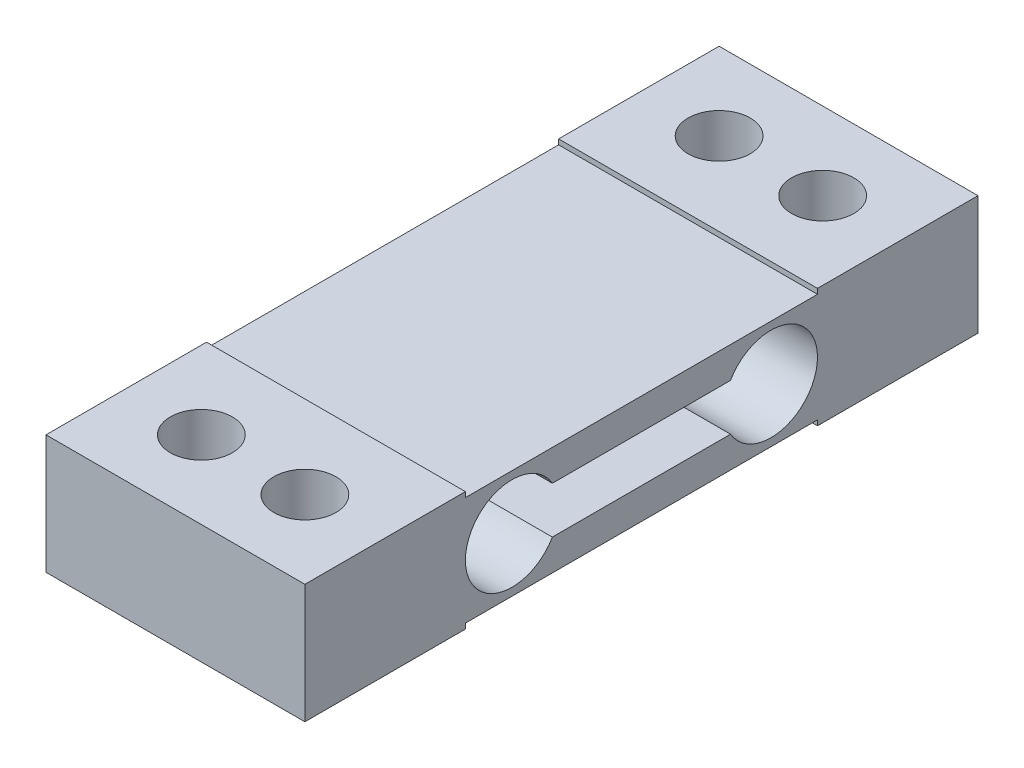
ISO-10303-21;
HEADER;
FILE_DESCRIPTION(('STEP AP214'),'2;1');
FILE_NAME('part.step','',(''),(''),'','','');
FILE_SCHEMA(('AUTOMOTIVE_DESIGN { 1 0 10303 214 1 1 1 1 }'));
ENDSEC;
DATA;
#1=APPLICATION_CONTEXT('core data for automotive mechanical design processes');
#2=APPLICATION_PROTOCOL_DEFINITION('international standard','automotive_design',2000,#1);
#3=PRODUCT_CONTEXT('',#1,'mechanical');
#4=PRODUCT('Part','Part','',(#3));
#5=PRODUCT_RELATED_PRODUCT_CATEGORY('part','',(#4));
#6=PRODUCT_DEFINITION_FORMATION('','',#4);
#7=PRODUCT_DEFINITION_CONTEXT('part definition',#1,'design');
#8=PRODUCT_DEFINITION('design','',#6,#7);
#9=PRODUCT_DEFINITION_SHAPE('','',#8);
#10=(LENGTH_UNIT() NAMED_UNIT(*) SI_UNIT(.MILLI.,.METRE.));
#11=(NAMED_UNIT(*) PLANE_ANGLE_UNIT() SI_UNIT($,.RADIAN.));
#12=(NAMED_UNIT(*) SI_UNIT($,.STERADIAN.) SOLID_ANGLE_UNIT());
#13=UNCERTAINTY_MEASURE_WITH_UNIT(LENGTH_MEASURE(1.E-05),#10,'distance_accuracy_value','');
#14=(GEOMETRIC_REPRESENTATION_CONTEXT(3) GLOBAL_UNCERTAINTY_ASSIGNED_CONTEXT((#13)) GLOBAL_UNIT_ASSIGNED_CONTEXT((#10,
#11,#12)) REPRESENTATION_CONTEXT('',''));
#15=CARTESIAN_POINT('',(0.,0.,0.));
#16=DIRECTION('',(0.,0.,1.));
#17=DIRECTION('',(1.,0.,0.));
#18=AXIS2_PLACEMENT_3D('',#15,#16,#17);
#19=CARTESIAN_POINT('',(50.,0.,0.));
#20=DIRECTION('',(0.,1.,0.));
#21=DIRECTION('',(0.,0.,1.));
#22=AXIS2_PLACEMENT_3D('',#19,#20,#21);
#23=PLANE('',#22);
#24=CARTESIAN_POINT('',(35.,0.,-115.));
#25=DIRECTION('',(0.,1.,0.));
#26=DIRECTION('',(0.,0.,1.));
#27=AXIS2_PLACEMENT_3D('',#24,#25,#26);
#28=CIRCLE('',#27,6.);
#29=CARTESIAN_POINT('',(35.,0.,-109.));
#30=VERTEX_POINT('',#29);
#31=EDGE_CURVE('E203',#30,#30,#28,.T.);
#32=ORIENTED_EDGE('',*,*,#31,.T.);
#33=EDGE_LOOP('',(#32));
#34=FACE_BOUND('',#33,.T.);
#35=CARTESIAN_POINT('',(15.,0.,-115.));
#36=DIRECTION('',(0.,1.,0.));
#37=DIRECTION('',(0.,0.,-1.));
#38=AXIS2_PLACEMENT_3D('',#35,#36,#37);
#39=CIRCLE('',#38,6.);
#40=CARTESIAN_POINT('',(15.,0.,-121.));
#41=VERTEX_POINT('',#40);
#42=EDGE_CURVE('E216',#41,#41,#39,.T.);
#43=ORIENTED_EDGE('',*,*,#42,.T.);
#44=EDGE_LOOP('',(#43));
#45=FACE_BOUND('',#44,.T.);
#46=DIRECTION('',(0.,0.,-1.));
#47=VECTOR('',#46,1.);
#48=CARTESIAN_POINT('',(50.,0.,0.));
#49=LINE('',#48,#47);
#50=CARTESIAN_POINT('',(50.,0.,-99.));
#51=VERTEX_POINT('',#50);
#52=CARTESIAN_POINT('',(50.,0.,-130.));
#53=VERTEX_POINT('',#52);
#54=EDGE_CURVE('E260',#51,#53,#49,.T.);
#55=ORIENTED_EDGE('',*,*,#54,.F.);
#56=DIRECTION('',(1.,0.,0.));
#57=VECTOR('',#56,1.);
#58=CARTESIAN_POINT('',(0.,0.,-99.));
#59=LINE('',#58,#57);
#60=CARTESIAN_POINT('',(0.,0.,-99.));
#61=VERTEX_POINT('',#60);
#62=EDGE_CURVE('E164',#61,#51,#59,.T.);
#63=ORIENTED_EDGE('',*,*,#62,.F.);
#64=DIRECTION('',(0.,0.,-1.));
#65=VECTOR('',#64,1.);
#66=CARTESIAN_POINT('',(0.,0.,0.));
#67=LINE('',#66,#65);
#68=CARTESIAN_POINT('',(0.,0.,-130.));
#69=VERTEX_POINT('',#68);
#70=EDGE_CURVE('E272',#61,#69,#67,.T.);
#71=ORIENTED_EDGE('',*,*,#70,.T.);
#72=DIRECTION('',(-1.,0.,0.));
#73=VECTOR('',#72,1.);
#74=CARTESIAN_POINT('',(50.,0.,-130.));
#75=LINE('',#74,#73);
#76=EDGE_CURVE('E44',#53,#69,#75,.T.);
#77=ORIENTED_EDGE('',*,*,#76,.F.);
#78=EDGE_LOOP('',(#55,#63,#71,#77));
#79=FACE_BOUND('',#78,.T.);
#80=ADVANCED_FACE('F36',(#34,#45,#79),#23,.F.);
#81=CARTESIAN_POINT('',(50.,0.,0.));
#82=DIRECTION('',(-1.,0.,0.));
#83=DIRECTION('',(0.,0.,1.));
#84=AXIS2_PLACEMENT_3D('',#81,#82,#83);
#85=PLANE('',#84);
#86=CARTESIAN_POINT('',(50.,11.5,-40.));
#87=DIRECTION('',(1.,0.,0.));
#88=DIRECTION('',(0.,0.,1.));
#89=AXIS2_PLACEMENT_3D('',#86,#87,#88);
#90=CIRCLE('',#89,8.99999999999999);
#91=CARTESIAN_POINT('',(50.,16.,-47.7942286340599));
#92=VERTEX_POINT('',#91);
#93=CARTESIAN_POINT('',(50.,7.,-47.7942286340599));
#94=VERTEX_POINT('',#93);
#95=EDGE_CURVE('E227',#92,#94,#90,.T.);
#96=ORIENTED_EDGE('',*,*,#95,.F.);
#97=DIRECTION('',(0.,0.,1.));
#98=VECTOR('',#97,1.);
#99=CARTESIAN_POINT('',(50.,16.,-82.2057713659401));
#100=LINE('',#99,#98);
#101=CARTESIAN_POINT('',(50.,16.,-82.2057713659401));
#102=VERTEX_POINT('',#101);
#103=EDGE_CURVE('E235',#102,#92,#100,.T.);
#104=ORIENTED_EDGE('',*,*,#103,.F.);
#105=CARTESIAN_POINT('',(50.,11.5,-90.));
#106=DIRECTION('',(1.,0.,0.));
#107=DIRECTION('',(0.,0.,-1.));
#108=AXIS2_PLACEMENT_3D('',#105,#106,#107);
#109=CIRCLE('',#108,8.99999999999999);
#110=CARTESIAN_POINT('',(50.,7.,-82.2057713659401));
#111=VERTEX_POINT('',#110);
#112=EDGE_CURVE('E232',#111,#102,#109,.T.);
#113=ORIENTED_EDGE('',*,*,#112,.F.);
#114=DIRECTION('',(0.,0.,-1.));
#115=VECTOR('',#114,1.);
#116=CARTESIAN_POINT('',(50.,7.,-82.2057713659401));
#117=LINE('',#116,#115);
#118=EDGE_CURVE('E229',#94,#111,#117,.T.);
#119=ORIENTED_EDGE('',*,*,#118,.F.);
#120=EDGE_LOOP('',(#96,#104,#113,#119));
#121=FACE_BOUND('',#120,.T.);
#122=DIRECTION('',(0.,0.,1.));
#123=VECTOR('',#122,1.);
#124=CARTESIAN_POINT('',(50.,1.,-31.));
#125=LINE('',#124,#123);
#126=CARTESIAN_POINT('',(50.,1.,-99.));
#127=VERTEX_POINT('',#126);
#128=CARTESIAN_POINT('',(50.,1.,-31.));
#129=VERTEX_POINT('',#128);
#130=EDGE_CURVE('E155',#127,#129,#125,.T.);
#131=ORIENTED_EDGE('',*,*,#130,.F.);
#132=DIRECTION('',(0.,-1.,0.));
#133=VECTOR('',#132,1.);
#134=CARTESIAN_POINT('',(50.,1.,-99.));
#135=LINE('',#134,#133);
#136=EDGE_CURVE('E190',#127,#51,#135,.T.);
#137=ORIENTED_EDGE('',*,*,#136,.T.);
#138=ORIENTED_EDGE('',*,*,#54,.T.);
#139=DIRECTION('',(0.,1.,0.));
#140=VECTOR('',#139,1.);
#141=CARTESIAN_POINT('',(50.,0.,-130.));
#142=LINE('',#141,#140);
#143=CARTESIAN_POINT('',(50.,23.,-130.));
#144=VERTEX_POINT('',#143);
#145=EDGE_CURVE('E263',#53,#144,#142,.T.);
#146=ORIENTED_EDGE('',*,*,#145,.T.);
#147=DIRECTION('',(0.,0.,1.));
#148=VECTOR('',#147,1.);
#149=CARTESIAN_POINT('',(50.,23.,0.));
#150=LINE('',#149,#148);
#151=CARTESIAN_POINT('',(50.,23.,-99.));
#152=VERTEX_POINT('',#151);
#153=EDGE_CURVE('E266',#144,#152,#150,.T.);
#154=ORIENTED_EDGE('',*,*,#153,.T.);
#155=DIRECTION('',(0.,1.,0.));
#156=VECTOR('',#155,1.);
#157=CARTESIAN_POINT('',(50.,22.,-99.));
#158=LINE('',#157,#156);
#159=CARTESIAN_POINT('',(50.,22.,-99.));
#160=VERTEX_POINT('',#159);
#161=EDGE_CURVE('E197',#160,#152,#158,.T.);
#162=ORIENTED_EDGE('',*,*,#161,.F.);
#163=DIRECTION('',(0.,0.,-1.));
#164=VECTOR('',#163,1.);
#165=CARTESIAN_POINT('',(50.,22.,0.));
#166=LINE('',#165,#164);
#167=CARTESIAN_POINT('',(50.,22.,-31.));
#168=VERTEX_POINT('',#167);
#169=EDGE_CURVE('E183',#168,#160,#166,.T.);
#170=ORIENTED_EDGE('',*,*,#169,.F.);
#171=DIRECTION('',(0.,1.,0.));
#172=VECTOR('',#171,1.);
#173=CARTESIAN_POINT('',(50.,22.,-31.));
#174=LINE('',#173,#172);
#175=CARTESIAN_POINT('',(50.,23.,-31.));
#176=VERTEX_POINT('',#175);
#177=EDGE_CURVE('E199',#168,#176,#174,.T.);
#178=ORIENTED_EDGE('',*,*,#177,.T.);
#179=CARTESIAN_POINT('',(50.,23.,0.));
#180=VERTEX_POINT('',#179);
#181=EDGE_CURVE('E265',#176,#180,#150,.T.);
#182=ORIENTED_EDGE('',*,*,#181,.T.);
#183=DIRECTION('',(0.,-1.,0.));
#184=VECTOR('',#183,1.);
#185=CARTESIAN_POINT('',(50.,0.,0.));
#186=LINE('',#185,#184);
#187=CARTESIAN_POINT('',(50.,0.,0.));
#188=VERTEX_POINT('',#187);
#189=EDGE_CURVE('E258',#180,#188,#186,.T.);
#190=ORIENTED_EDGE('',*,*,#189,.T.);
#191=CARTESIAN_POINT('',(50.,0.,-31.));
#192=VERTEX_POINT('',#191);
#193=EDGE_CURVE('E169',#188,#192,#49,.T.);
#194=ORIENTED_EDGE('',*,*,#193,.T.);
#195=DIRECTION('',(0.,-1.,0.));
#196=VECTOR('',#195,1.);
#197=CARTESIAN_POINT('',(50.,1.,-31.));
#198=LINE('',#197,#196);
#199=EDGE_CURVE('E51',#129,#192,#198,.T.);
#200=ORIENTED_EDGE('',*,*,#199,.F.);
#201=EDGE_LOOP('',(#131,#137,#138,#146,#154,#162,#170,#178,#182,#190,#194,#200));
#202=FACE_BOUND('',#201,.T.);
#203=ADVANCED_FACE('F167',(#121,#202),#85,.F.);
#204=CARTESIAN_POINT('',(0.,0.,0.));
#205=DIRECTION('',(-1.,0.,0.));
#206=DIRECTION('',(0.,0.,1.));
#207=AXIS2_PLACEMENT_3D('',#204,#205,#206);
#208=PLANE('',#207);
#209=DIRECTION('',(0.,-1.,0.));
#210=VECTOR('',#209,1.);
#211=CARTESIAN_POINT('',(0.,1.,-99.));
#212=LINE('',#211,#210);
#213=CARTESIAN_POINT('',(0.,1.,-99.));
#214=VERTEX_POINT('',#213);
#215=EDGE_CURVE('E171',#214,#61,#212,.T.);
#216=ORIENTED_EDGE('',*,*,#215,.F.);
#217=DIRECTION('',(0.,0.,-1.));
#218=VECTOR('',#217,1.);
#219=CARTESIAN_POINT('',(0.,1.,-31.));
#220=LINE('',#219,#218);
#221=CARTESIAN_POINT('',(0.,1.,-31.));
#222=VERTEX_POINT('',#221);
#223=EDGE_CURVE('E154',#222,#214,#220,.T.);
#224=ORIENTED_EDGE('',*,*,#223,.F.);
#225=DIRECTION('',(0.,-1.,0.));
#226=VECTOR('',#225,1.);
#227=CARTESIAN_POINT('',(0.,1.,-31.));
#228=LINE('',#227,#226);
#229=CARTESIAN_POINT('',(0.,0.,-31.));
#230=VERTEX_POINT('',#229);
#231=EDGE_CURVE('E151',#222,#230,#228,.T.);
#232=ORIENTED_EDGE('',*,*,#231,.T.);
#233=CARTESIAN_POINT('',(0.,0.,0.));
#234=VERTEX_POINT('',#233);
#235=EDGE_CURVE('E273',#234,#230,#67,.T.);
#236=ORIENTED_EDGE('',*,*,#235,.F.);
#237=DIRECTION('',(0.,-1.,0.));
#238=VECTOR('',#237,1.);
#239=CARTESIAN_POINT('',(0.,0.,0.));
#240=LINE('',#239,#238);
#241=CARTESIAN_POINT('',(0.,23.,0.));
#242=VERTEX_POINT('',#241);
#243=EDGE_CURVE('E257',#242,#234,#240,.T.);
#244=ORIENTED_EDGE('',*,*,#243,.F.);
#245=DIRECTION('',(0.,0.,1.));
#246=VECTOR('',#245,1.);
#247=CARTESIAN_POINT('',(0.,23.,0.));
#248=LINE('',#247,#246);
#249=CARTESIAN_POINT('',(0.,23.,-31.));
#250=VERTEX_POINT('',#249);
#251=EDGE_CURVE('E278',#250,#242,#248,.T.);
#252=ORIENTED_EDGE('',*,*,#251,.F.);
#253=DIRECTION('',(0.,1.,0.));
#254=VECTOR('',#253,1.);
#255=CARTESIAN_POINT('',(0.,22.,-31.));
#256=LINE('',#255,#254);
#257=CARTESIAN_POINT('',(0.,22.,-31.));
#258=VERTEX_POINT('',#257);
#259=EDGE_CURVE('E59',#258,#250,#256,.T.);
#260=ORIENTED_EDGE('',*,*,#259,.F.);
#261=DIRECTION('',(0.,0.,1.));
#262=VECTOR('',#261,1.);
#263=CARTESIAN_POINT('',(0.,22.,0.));
#264=LINE('',#263,#262);
#265=CARTESIAN_POINT('',(0.,22.,-99.));
#266=VERTEX_POINT('',#265);
#267=EDGE_CURVE('E176',#266,#258,#264,.T.);
#268=ORIENTED_EDGE('',*,*,#267,.F.);
#269=DIRECTION('',(0.,1.,0.));
#270=VECTOR('',#269,1.);
#271=CARTESIAN_POINT('',(0.,22.,-99.));
#272=LINE('',#271,#270);
#273=CARTESIAN_POINT('',(0.,23.,-99.));
#274=VERTEX_POINT('',#273);
#275=EDGE_CURVE('E193',#266,#274,#272,.T.);
#276=ORIENTED_EDGE('',*,*,#275,.T.);
#277=CARTESIAN_POINT('',(0.,23.,-130.));
#278=VERTEX_POINT('',#277);
#279=EDGE_CURVE('E261',#278,#274,#248,.T.);
#280=ORIENTED_EDGE('',*,*,#279,.F.);
#281=DIRECTION('',(0.,1.,0.));
#282=VECTOR('',#281,1.);
#283=CARTESIAN_POINT('',(0.,0.,-130.));
#284=LINE('',#283,#282);
#285=EDGE_CURVE('E276',#69,#278,#284,.T.);
#286=ORIENTED_EDGE('',*,*,#285,.F.);
#287=ORIENTED_EDGE('',*,*,#70,.F.);
#288=EDGE_LOOP('',(#216,#224,#232,#236,#244,#252,#260,#268,#276,#280,#286,#287));
#289=FACE_BOUND('',#288,.T.);
#290=DIRECTION('',(0.,0.,1.));
#291=VECTOR('',#290,1.);
#292=CARTESIAN_POINT('',(0.,16.,-82.2057713659401));
#293=LINE('',#292,#291);
#294=CARTESIAN_POINT('',(0.,16.,-82.2057713659401));
#295=VERTEX_POINT('',#294);
#296=CARTESIAN_POINT('',(0.,16.,-47.7942286340599));
#297=VERTEX_POINT('',#296);
#298=EDGE_CURVE('E230',#295,#297,#293,.T.);
#299=ORIENTED_EDGE('',*,*,#298,.T.);
#300=CARTESIAN_POINT('',(0.,11.5,-40.));
#301=DIRECTION('',(1.,0.,0.));
#302=DIRECTION('',(0.,0.,1.));
#303=AXIS2_PLACEMENT_3D('',#300,#301,#302);
#304=CIRCLE('',#303,8.99999999999999);
#305=CARTESIAN_POINT('',(0.,7.,-47.7942286340599));
#306=VERTEX_POINT('',#305);
#307=EDGE_CURVE('E224',#297,#306,#304,.T.);
#308=ORIENTED_EDGE('',*,*,#307,.T.);
#309=DIRECTION('',(0.,0.,-1.));
#310=VECTOR('',#309,1.);
#311=CARTESIAN_POINT('',(0.,7.,-82.2057713659401));
#312=LINE('',#311,#310);
#313=CARTESIAN_POINT('',(0.,7.,-82.2057713659401));
#314=VERTEX_POINT('',#313);
#315=EDGE_CURVE('E240',#306,#314,#312,.T.);
#316=ORIENTED_EDGE('',*,*,#315,.T.);
#317=CARTESIAN_POINT('',(0.,11.5,-90.));
#318=DIRECTION('',(1.,0.,0.));
#319=DIRECTION('',(0.,0.,-1.));
#320=AXIS2_PLACEMENT_3D('',#317,#318,#319);
#321=CIRCLE('',#320,8.99999999999999);
#322=EDGE_CURVE('E243',#314,#295,#321,.T.);
#323=ORIENTED_EDGE('',*,*,#322,.T.);
#324=EDGE_LOOP('',(#299,#308,#316,#323));
#325=FACE_BOUND('',#324,.T.);
#326=ADVANCED_FACE('F298',(#289,#325),#208,.T.);
#327=CARTESIAN_POINT('',(50.,23.,0.));
#328=DIRECTION('',(0.,-1.,0.));
#329=DIRECTION('',(0.,0.,-1.));
#330=AXIS2_PLACEMENT_3D('',#327,#328,#329);
#331=PLANE('',#330);
#332=CARTESIAN_POINT('',(15.,23.,-115.));
#333=DIRECTION('',(0.,1.,0.));
#334=DIRECTION('',(0.,0.,-1.));
#335=AXIS2_PLACEMENT_3D('',#332,#333,#334);
#336=CIRCLE('',#335,6.);
#337=CARTESIAN_POINT('',(15.,23.,-121.));
#338=VERTEX_POINT('',#337);
#339=EDGE_CURVE('E206',#338,#338,#336,.T.);
#340=ORIENTED_EDGE('',*,*,#339,.F.);
#341=EDGE_LOOP('',(#340));
#342=FACE_BOUND('',#341,.T.);
#343=CARTESIAN_POINT('',(35.,23.,-115.));
#344=DIRECTION('',(0.,1.,0.));
#345=DIRECTION('',(0.,0.,1.));
#346=AXIS2_PLACEMENT_3D('',#343,#344,#345);
#347=CIRCLE('',#346,6.);
#348=CARTESIAN_POINT('',(35.,23.,-109.));
#349=VERTEX_POINT('',#348);
#350=EDGE_CURVE('E196',#349,#349,#347,.T.);
#351=ORIENTED_EDGE('',*,*,#350,.F.);
#352=EDGE_LOOP('',(#351));
#353=FACE_BOUND('',#352,.T.);
#354=DIRECTION('',(1.,0.,0.));
#355=VECTOR('',#354,1.);
#356=CARTESIAN_POINT('',(0.,23.,-99.));
#357=LINE('',#356,#355);
#358=EDGE_CURVE('E180',#274,#152,#357,.T.);
#359=ORIENTED_EDGE('',*,*,#358,.T.);
#360=ORIENTED_EDGE('',*,*,#153,.F.);
#361=DIRECTION('',(-1.,0.,0.));
#362=VECTOR('',#361,1.);
#363=CARTESIAN_POINT('',(50.,23.,-130.));
#364=LINE('',#363,#362);
#365=EDGE_CURVE('E283',#144,#278,#364,.T.);
#366=ORIENTED_EDGE('',*,*,#365,.T.);
#367=ORIENTED_EDGE('',*,*,#279,.T.);
#368=EDGE_LOOP('',(#359,#360,#366,#367));
#369=FACE_BOUND('',#368,.T.);
#370=ADVANCED_FACE('F302',(#342,#353,#369),#331,.F.);
#371=CARTESIAN_POINT('',(50.,0.,0.));
#372=DIRECTION('',(0.,0.,-1.));
#373=DIRECTION('',(-1.,0.,0.));
#374=AXIS2_PLACEMENT_3D('',#371,#372,#373);
#375=PLANE('',#374);
#376=ORIENTED_EDGE('',*,*,#243,.T.);
#377=DIRECTION('',(-1.,0.,0.));
#378=VECTOR('',#377,1.);
#379=CARTESIAN_POINT('',(50.,0.,0.));
#380=LINE('',#379,#378);
#381=EDGE_CURVE('E11',#188,#234,#380,.T.);
#382=ORIENTED_EDGE('',*,*,#381,.F.);
#383=ORIENTED_EDGE('',*,*,#189,.F.);
#384=DIRECTION('',(-1.,0.,0.));
#385=VECTOR('',#384,1.);
#386=CARTESIAN_POINT('',(50.,23.,0.));
#387=LINE('',#386,#385);
#388=EDGE_CURVE('E269',#180,#242,#387,.T.);
#389=ORIENTED_EDGE('',*,*,#388,.T.);
#390=EDGE_LOOP('',(#376,#382,#383,#389));
#391=FACE_BOUND('',#390,.T.);
#392=ADVANCED_FACE('F38',(#391),#375,.F.);
#393=CARTESIAN_POINT('',(35.,0.,-15.));
#394=DIRECTION('',(0.,1.,0.));
#395=DIRECTION('',(0.,0.,-1.));
#396=AXIS2_PLACEMENT_3D('',#393,#394,#395);
#397=CIRCLE('',#396,6.);
#398=CARTESIAN_POINT('',(35.,0.,-21.));
#399=VERTEX_POINT('',#398);
#400=EDGE_CURVE('E209',#399,#399,#397,.T.);
#401=ORIENTED_EDGE('',*,*,#400,.T.);
#402=EDGE_LOOP('',(#401));
#403=FACE_BOUND('',#402,.T.);
#404=CARTESIAN_POINT('',(15.,0.,-15.));
#405=DIRECTION('',(0.,1.,0.));
#406=DIRECTION('',(0.,0.,1.));
#407=AXIS2_PLACEMENT_3D('',#404,#405,#406);
#408=CIRCLE('',#407,6.);
#409=CARTESIAN_POINT('',(15.,0.,-9.));
#410=VERTEX_POINT('',#409);
#411=EDGE_CURVE('E221',#410,#410,#408,.T.);
#412=ORIENTED_EDGE('',*,*,#411,.T.);
#413=EDGE_LOOP('',(#412));
#414=FACE_BOUND('',#413,.T.);
#415=ORIENTED_EDGE('',*,*,#235,.T.);
#416=DIRECTION('',(-1.,0.,0.));
#417=VECTOR('',#416,1.);
#418=CARTESIAN_POINT('',(0.,0.,-31.));
#419=LINE('',#418,#417);
#420=EDGE_CURVE('E308',#192,#230,#419,.T.);
#421=ORIENTED_EDGE('',*,*,#420,.F.);
#422=ORIENTED_EDGE('',*,*,#193,.F.);
#423=ORIENTED_EDGE('',*,*,#381,.T.);
#424=EDGE_LOOP('',(#415,#421,#422,#423));
#425=FACE_BOUND('',#424,.T.);
#426=ADVANCED_FACE('F316',(#403,#414,#425),#23,.F.);
#427=CARTESIAN_POINT('',(50.,0.,-130.));
#428=DIRECTION('',(0.,0.,1.));
#429=DIRECTION('',(1.,0.,0.));
#430=AXIS2_PLACEMENT_3D('',#427,#428,#429);
#431=PLANE('',#430);
#432=ORIENTED_EDGE('',*,*,#285,.T.);
#433=ORIENTED_EDGE('',*,*,#365,.F.);
#434=ORIENTED_EDGE('',*,*,#145,.F.);
#435=ORIENTED_EDGE('',*,*,#76,.T.);
#436=EDGE_LOOP('',(#432,#433,#434,#435));
#437=FACE_BOUND('',#436,.T.);
#438=ADVANCED_FACE('F290',(#437),#431,.F.);
#439=CARTESIAN_POINT('',(35.,23.,-15.));
#440=DIRECTION('',(0.,1.,0.));
#441=DIRECTION('',(0.,0.,-1.));
#442=AXIS2_PLACEMENT_3D('',#439,#440,#441);
#443=CIRCLE('',#442,6.);
#444=CARTESIAN_POINT('',(35.,23.,-21.));
#445=VERTEX_POINT('',#444);
#446=EDGE_CURVE('E213',#445,#445,#443,.T.);
#447=ORIENTED_EDGE('',*,*,#446,.F.);
#448=EDGE_LOOP('',(#447));
#449=FACE_BOUND('',#448,.T.);
#450=CARTESIAN_POINT('',(15.,23.,-15.));
#451=DIRECTION('',(0.,1.,0.));
#452=DIRECTION('',(0.,0.,1.));
#453=AXIS2_PLACEMENT_3D('',#450,#451,#452);
#454=CIRCLE('',#453,6.);
#455=CARTESIAN_POINT('',(15.,23.,-9.));
#456=VERTEX_POINT('',#455);
#457=EDGE_CURVE('E212',#456,#456,#454,.T.);
#458=ORIENTED_EDGE('',*,*,#457,.F.);
#459=EDGE_LOOP('',(#458));
#460=FACE_BOUND('',#459,.T.);
#461=ORIENTED_EDGE('',*,*,#181,.F.);
#462=DIRECTION('',(1.,0.,0.));
#463=VECTOR('',#462,1.);
#464=CARTESIAN_POINT('',(0.,23.,-31.));
#465=LINE('',#464,#463);
#466=EDGE_CURVE('E188',#250,#176,#465,.T.);
#467=ORIENTED_EDGE('',*,*,#466,.F.);
#468=ORIENTED_EDGE('',*,*,#251,.T.);
#469=ORIENTED_EDGE('',*,*,#388,.F.);
#470=EDGE_LOOP('',(#461,#467,#468,#469));
#471=FACE_BOUND('',#470,.T.);
#472=ADVANCED_FACE('F324',(#449,#460,#471),#331,.F.);
#473=CARTESIAN_POINT('',(50.,11.5,-40.));
#474=DIRECTION('',(-1.,0.,0.));
#475=DIRECTION('',(0.,0.,1.));
#476=AXIS2_PLACEMENT_3D('',#473,#474,#475);
#477=CYLINDRICAL_SURFACE('',#476,8.99999999999999);
#478=ORIENTED_EDGE('',*,*,#307,.F.);
#479=DIRECTION('',(-1.,0.,0.));
#480=VECTOR('',#479,1.);
#481=CARTESIAN_POINT('',(50.,16.,-47.7942286340599));
#482=LINE('',#481,#480);
#483=EDGE_CURVE('E237',#92,#297,#482,.T.);
#484=ORIENTED_EDGE('',*,*,#483,.F.);
#485=ORIENTED_EDGE('',*,*,#95,.T.);
#486=DIRECTION('',(-1.,0.,0.));
#487=VECTOR('',#486,1.);
#488=CARTESIAN_POINT('',(50.,7.,-47.7942286340599));
#489=LINE('',#488,#487);
#490=EDGE_CURVE('E254',#94,#306,#489,.T.);
#491=ORIENTED_EDGE('',*,*,#490,.T.);
#492=EDGE_LOOP('',(#478,#484,#485,#491));
#493=FACE_BOUND('',#492,.T.);
#494=ADVANCED_FACE('F371',(#493),#477,.F.);
#495=CARTESIAN_POINT('',(50.,7.,-82.2057713659401));
#496=DIRECTION('',(0.,1.,0.));
#497=DIRECTION('',(0.,0.,1.));
#498=AXIS2_PLACEMENT_3D('',#495,#496,#497);
#499=PLANE('',#498);
#500=ORIENTED_EDGE('',*,*,#315,.F.);
#501=ORIENTED_EDGE('',*,*,#490,.F.);
#502=ORIENTED_EDGE('',*,*,#118,.T.);
#503=DIRECTION('',(-1.,0.,0.));
#504=VECTOR('',#503,1.);
#505=CARTESIAN_POINT('',(50.,7.,-82.2057713659401));
#506=LINE('',#505,#504);
#507=EDGE_CURVE('E252',#111,#314,#506,.T.);
#508=ORIENTED_EDGE('',*,*,#507,.T.);
#509=EDGE_LOOP('',(#500,#501,#502,#508));
#510=FACE_BOUND('',#509,.T.);
#511=ADVANCED_FACE('F377',(#510),#499,.T.);
#512=CARTESIAN_POINT('',(50.,11.5,-90.));
#513=DIRECTION('',(-1.,0.,0.));
#514=DIRECTION('',(0.,0.,1.));
#515=AXIS2_PLACEMENT_3D('',#512,#513,#514);
#516=CYLINDRICAL_SURFACE('',#515,8.99999999999999);
#517=ORIENTED_EDGE('',*,*,#322,.F.);
#518=ORIENTED_EDGE('',*,*,#507,.F.);
#519=ORIENTED_EDGE('',*,*,#112,.T.);
#520=DIRECTION('',(-1.,0.,0.));
#521=VECTOR('',#520,1.);
#522=CARTESIAN_POINT('',(50.,16.,-82.2057713659401));
#523=LINE('',#522,#521);
#524=EDGE_CURVE('E250',#102,#295,#523,.T.);
#525=ORIENTED_EDGE('',*,*,#524,.T.);
#526=EDGE_LOOP('',(#517,#518,#519,#525));
#527=FACE_BOUND('',#526,.T.);
#528=ADVANCED_FACE('F403',(#527),#516,.F.);
#529=CARTESIAN_POINT('',(50.,16.,-82.2057713659401));
#530=DIRECTION('',(0.,-1.,0.));
#531=DIRECTION('',(0.,0.,-1.));
#532=AXIS2_PLACEMENT_3D('',#529,#530,#531);
#533=PLANE('',#532);
#534=ORIENTED_EDGE('',*,*,#298,.F.);
#535=ORIENTED_EDGE('',*,*,#524,.F.);
#536=ORIENTED_EDGE('',*,*,#103,.T.);
#537=ORIENTED_EDGE('',*,*,#483,.T.);
#538=EDGE_LOOP('',(#534,#535,#536,#537));
#539=FACE_BOUND('',#538,.T.);
#540=ADVANCED_FACE('F366',(#539),#533,.T.);
#541=CARTESIAN_POINT('',(15.,0.,-15.));
#542=DIRECTION('',(0.,1.,0.));
#543=DIRECTION('',(0.,0.,1.));
#544=AXIS2_PLACEMENT_3D('',#541,#542,#543);
#545=CYLINDRICAL_SURFACE('',#544,6.);
#546=ORIENTED_EDGE('',*,*,#411,.F.);
#547=EDGE_LOOP('',(#546));
#548=FACE_BOUND('',#547,.T.);
#549=ORIENTED_EDGE('',*,*,#457,.T.);
#550=EDGE_LOOP('',(#549));
#551=FACE_BOUND('',#550,.T.);
#552=ADVANCED_FACE('F362',(#548,#551),#545,.F.);
#553=CARTESIAN_POINT('',(35.,0.,-115.));
#554=DIRECTION('',(0.,1.,0.));
#555=DIRECTION('',(0.,0.,1.));
#556=AXIS2_PLACEMENT_3D('',#553,#554,#555);
#557=CYLINDRICAL_SURFACE('',#556,6.);
#558=ORIENTED_EDGE('',*,*,#31,.F.);
#559=EDGE_LOOP('',(#558));
#560=FACE_BOUND('',#559,.T.);
#561=ORIENTED_EDGE('',*,*,#350,.T.);
#562=EDGE_LOOP('',(#561));
#563=FACE_BOUND('',#562,.T.);
#564=ADVANCED_FACE('F365',(#560,#563),#557,.F.);
#565=CARTESIAN_POINT('',(15.,0.,-115.));
#566=DIRECTION('',(0.,1.,0.));
#567=DIRECTION('',(0.,0.,1.));
#568=AXIS2_PLACEMENT_3D('',#565,#566,#567);
#569=CYLINDRICAL_SURFACE('',#568,6.);
#570=ORIENTED_EDGE('',*,*,#42,.F.);
#571=EDGE_LOOP('',(#570));
#572=FACE_BOUND('',#571,.T.);
#573=ORIENTED_EDGE('',*,*,#339,.T.);
#574=EDGE_LOOP('',(#573));
#575=FACE_BOUND('',#574,.T.);
#576=ADVANCED_FACE('F339',(#572,#575),#569,.F.);
#577=CARTESIAN_POINT('',(35.,0.,-15.));
#578=DIRECTION('',(0.,1.,0.));
#579=DIRECTION('',(0.,0.,1.));
#580=AXIS2_PLACEMENT_3D('',#577,#578,#579);
#581=CYLINDRICAL_SURFACE('',#580,6.);
#582=ORIENTED_EDGE('',*,*,#400,.F.);
#583=EDGE_LOOP('',(#582));
#584=FACE_BOUND('',#583,.T.);
#585=ORIENTED_EDGE('',*,*,#446,.T.);
#586=EDGE_LOOP('',(#585));
#587=FACE_BOUND('',#586,.T.);
#588=ADVANCED_FACE('F332',(#584,#587),#581,.F.);
#589=CARTESIAN_POINT('',(0.,22.,-99.));
#590=DIRECTION('',(0.,0.,1.));
#591=DIRECTION('',(1.,0.,0.));
#592=AXIS2_PLACEMENT_3D('',#589,#590,#591);
#593=PLANE('',#592);
#594=ORIENTED_EDGE('',*,*,#358,.F.);
#595=ORIENTED_EDGE('',*,*,#275,.F.);
#596=DIRECTION('',(1.,0.,0.));
#597=VECTOR('',#596,1.);
#598=CARTESIAN_POINT('',(0.,22.,-99.));
#599=LINE('',#598,#597);
#600=EDGE_CURVE('E186',#266,#160,#599,.T.);
#601=ORIENTED_EDGE('',*,*,#600,.T.);
#602=ORIENTED_EDGE('',*,*,#161,.T.);
#603=EDGE_LOOP('',(#594,#595,#601,#602));
#604=FACE_BOUND('',#603,.T.);
#605=ADVANCED_FACE('F330',(#604),#593,.T.);
#606=CARTESIAN_POINT('',(0.,22.,-31.));
#607=DIRECTION('',(0.,0.,1.));
#608=DIRECTION('',(1.,0.,0.));
#609=AXIS2_PLACEMENT_3D('',#606,#607,#608);
#610=PLANE('',#609);
#611=ORIENTED_EDGE('',*,*,#466,.T.);
#612=ORIENTED_EDGE('',*,*,#177,.F.);
#613=DIRECTION('',(1.,0.,0.));
#614=VECTOR('',#613,1.);
#615=CARTESIAN_POINT('',(0.,22.,-31.));
#616=LINE('',#615,#614);
#617=EDGE_CURVE('E179',#258,#168,#616,.T.);
#618=ORIENTED_EDGE('',*,*,#617,.F.);
#619=ORIENTED_EDGE('',*,*,#259,.T.);
#620=EDGE_LOOP('',(#611,#612,#618,#619));
#621=FACE_BOUND('',#620,.T.);
#622=ADVANCED_FACE('F325',(#621),#610,.F.);
#623=CARTESIAN_POINT('',(0.,22.,0.));
#624=DIRECTION('',(0.,1.,0.));
#625=DIRECTION('',(0.,0.,1.));
#626=AXIS2_PLACEMENT_3D('',#623,#624,#625);
#627=PLANE('',#626);
#628=ORIENTED_EDGE('',*,*,#267,.T.);
#629=ORIENTED_EDGE('',*,*,#617,.T.);
#630=ORIENTED_EDGE('',*,*,#169,.T.);
#631=ORIENTED_EDGE('',*,*,#600,.F.);
#632=EDGE_LOOP('',(#628,#629,#630,#631));
#633=FACE_BOUND('',#632,.T.);
#634=ADVANCED_FACE('F328',(#633),#627,.T.);
#635=CARTESIAN_POINT('',(0.,1.,-99.));
#636=DIRECTION('',(0.,0.,-1.));
#637=DIRECTION('',(-1.,0.,0.));
#638=AXIS2_PLACEMENT_3D('',#635,#636,#637);
#639=PLANE('',#638);
#640=ORIENTED_EDGE('',*,*,#62,.T.);
#641=ORIENTED_EDGE('',*,*,#136,.F.);
#642=DIRECTION('',(1.,0.,0.));
#643=VECTOR('',#642,1.);
#644=CARTESIAN_POINT('',(0.,1.,-99.));
#645=LINE('',#644,#643);
#646=EDGE_CURVE('E161',#214,#127,#645,.T.);
#647=ORIENTED_EDGE('',*,*,#646,.F.);
#648=ORIENTED_EDGE('',*,*,#215,.T.);
#649=EDGE_LOOP('',(#640,#641,#647,#648));
#650=FACE_BOUND('',#649,.T.);
#651=ADVANCED_FACE('F312',(#650),#639,.F.);
#652=CARTESIAN_POINT('',(0.,1.,-31.));
#653=DIRECTION('',(0.,0.,1.));
#654=DIRECTION('',(1.,0.,0.));
#655=AXIS2_PLACEMENT_3D('',#652,#653,#654);
#656=PLANE('',#655);
#657=ORIENTED_EDGE('',*,*,#420,.T.);
#658=ORIENTED_EDGE('',*,*,#231,.F.);
#659=DIRECTION('',(-1.,0.,0.));
#660=VECTOR('',#659,1.);
#661=CARTESIAN_POINT('',(0.,1.,-31.));
#662=LINE('',#661,#660);
#663=EDGE_CURVE('E147',#129,#222,#662,.T.);
#664=ORIENTED_EDGE('',*,*,#663,.F.);
#665=ORIENTED_EDGE('',*,*,#199,.T.);
#666=EDGE_LOOP('',(#657,#658,#664,#665));
#667=FACE_BOUND('',#666,.T.);
#668=ADVANCED_FACE('F149',(#667),#656,.F.);
#669=CARTESIAN_POINT('',(0.,1.,0.));
#670=DIRECTION('',(0.,-1.,0.));
#671=DIRECTION('',(0.,0.,-1.));
#672=AXIS2_PLACEMENT_3D('',#669,#670,#671);
#673=PLANE('',#672);
#674=ORIENTED_EDGE('',*,*,#130,.T.);
#675=ORIENTED_EDGE('',*,*,#663,.T.);
#676=ORIENTED_EDGE('',*,*,#223,.T.);
#677=ORIENTED_EDGE('',*,*,#646,.T.);
#678=EDGE_LOOP('',(#674,#675,#676,#677));
#679=FACE_BOUND('',#678,.T.);
#680=ADVANCED_FACE('F159',(#679),#673,.T.);
#681=CLOSED_SHELL('',(#80,#203,#326,#370,#392,#426,#438,#472,#494,#511,#528,#540,#552,#564,#576,
#588,#605,#622,#634,#651,#668,#680));
#682=MANIFOLD_SOLID_BREP('B2',#681);
#683=ADVANCED_BREP_SHAPE_REPRESENTATION('',(#18,#682),#14);
#684=SHAPE_DEFINITION_REPRESENTATION(#9,#683);
ENDSEC;
END-ISO-10303-21;
